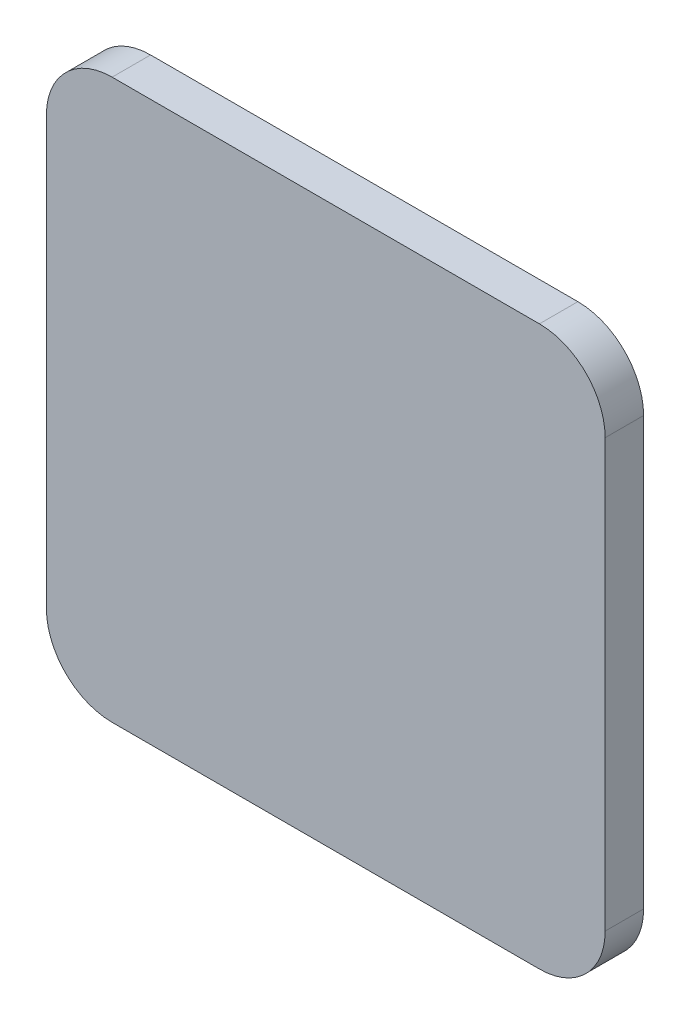
ISO-10303-21;
HEADER;
FILE_DESCRIPTION(('STEP AP214'),'2;1');
FILE_NAME('part.step','',(''),(''),'','','');
FILE_SCHEMA(('AUTOMOTIVE_DESIGN { 1 0 10303 214 1 1 1 1 }'));
ENDSEC;
DATA;
#1=APPLICATION_CONTEXT('core data for automotive mechanical design processes');
#2=APPLICATION_PROTOCOL_DEFINITION('international standard','automotive_design',2000,#1);
#3=PRODUCT_CONTEXT('',#1,'mechanical');
#4=PRODUCT('Part','Part','',(#3));
#5=PRODUCT_RELATED_PRODUCT_CATEGORY('part','',(#4));
#6=PRODUCT_DEFINITION_FORMATION('','',#4);
#7=PRODUCT_DEFINITION_CONTEXT('part definition',#1,'design');
#8=PRODUCT_DEFINITION('design','',#6,#7);
#9=PRODUCT_DEFINITION_SHAPE('','',#8);
#10=(LENGTH_UNIT() NAMED_UNIT(*) SI_UNIT(.MILLI.,.METRE.));
#11=(NAMED_UNIT(*) PLANE_ANGLE_UNIT() SI_UNIT($,.RADIAN.));
#12=(NAMED_UNIT(*) SI_UNIT($,.STERADIAN.) SOLID_ANGLE_UNIT());
#13=UNCERTAINTY_MEASURE_WITH_UNIT(LENGTH_MEASURE(1.E-05),#10,'distance_accuracy_value','');
#14=(GEOMETRIC_REPRESENTATION_CONTEXT(3) GLOBAL_UNCERTAINTY_ASSIGNED_CONTEXT((#13)) GLOBAL_UNIT_ASSIGNED_CONTEXT((#10,
#11,#12)) REPRESENTATION_CONTEXT('',''));
#15=CARTESIAN_POINT('',(0.,0.,0.));
#16=DIRECTION('',(0.,0.,1.));
#17=DIRECTION('',(1.,0.,0.));
#18=AXIS2_PLACEMENT_3D('',#15,#16,#17);
#19=CARTESIAN_POINT('',(14.781678488008,-85.1961296196214,126.358152801713));
#20=DIRECTION('',(0.,0.,-1.));
#21=DIRECTION('',(-1.,0.,0.));
#22=AXIS2_PLACEMENT_3D('',#19,#20,#21);
#23=CYLINDRICAL_SURFACE('',#22,10.);
#24=CARTESIAN_POINT('',(14.781678488008,-85.1961296196214,5.85000000000004));
#25=DIRECTION('',(0.,0.,1.));
#26=DIRECTION('',(0.,-1.,0.));
#27=AXIS2_PLACEMENT_3D('',#24,#25,#26);
#28=CIRCLE('',#27,10.);
#29=CARTESIAN_POINT('',(14.7816784880079,-95.1961296196214,5.85000000000003));
#30=VERTEX_POINT('',#29);
#31=CARTESIAN_POINT('',(24.781678488008,-85.1961296196213,5.85000000000004));
#32=VERTEX_POINT('',#31);
#33=EDGE_CURVE('E43',#30,#32,#28,.T.);
#34=ORIENTED_EDGE('',*,*,#33,.F.);
#35=DIRECTION('',(0.,0.,-1.));
#36=VECTOR('',#35,1.);
#37=CARTESIAN_POINT('',(14.7816784880079,-95.1961296196214,126.358152801713));
#38=LINE('',#37,#36);
#39=CARTESIAN_POINT('',(14.7816784880079,-95.1961296196214,0.));
#40=VERTEX_POINT('',#39);
#41=EDGE_CURVE('E38',#30,#40,#38,.T.);
#42=ORIENTED_EDGE('',*,*,#41,.T.);
#43=CARTESIAN_POINT('',(14.781678488008,-85.1961296196214,0.));
#44=DIRECTION('',(0.,0.,1.));
#45=DIRECTION('',(1.,0.,0.));
#46=AXIS2_PLACEMENT_3D('',#43,#44,#45);
#47=CIRCLE('',#46,10.);
#48=CARTESIAN_POINT('',(24.781678488008,-85.1961296196213,0.));
#49=VERTEX_POINT('',#48);
#50=EDGE_CURVE('E128',#40,#49,#47,.T.);
#51=ORIENTED_EDGE('',*,*,#50,.T.);
#52=DIRECTION('',(0.,0.,-1.));
#53=VECTOR('',#52,1.);
#54=CARTESIAN_POINT('',(24.781678488008,-85.1961296196213,126.358152801713));
#55=LINE('',#54,#53);
#56=EDGE_CURVE('E88',#32,#49,#55,.T.);
#57=ORIENTED_EDGE('',*,*,#56,.F.);
#58=EDGE_LOOP('',(#34,#42,#51,#57));
#59=FACE_BOUND('',#58,.T.);
#60=ADVANCED_FACE('F34',(#59),#23,.T.);
#61=CARTESIAN_POINT('',(24.781678488008,-85.1961296196213,126.358152801713));
#62=DIRECTION('',(-1.,0.,0.));
#63=DIRECTION('',(0.,0.,1.));
#64=AXIS2_PLACEMENT_3D('',#61,#62,#63);
#65=PLANE('',#64);
#66=DIRECTION('',(0.,1.,0.));
#67=VECTOR('',#66,1.);
#68=CARTESIAN_POINT('',(24.781678488008,-85.1961296196213,5.85000000000004));
#69=LINE('',#68,#67);
#70=CARTESIAN_POINT('',(24.781678488008,-20.1961296196215,5.85000000000004));
#71=VERTEX_POINT('',#70);
#72=EDGE_CURVE('E12',#32,#71,#69,.T.);
#73=ORIENTED_EDGE('',*,*,#72,.F.);
#74=ORIENTED_EDGE('',*,*,#56,.T.);
#75=DIRECTION('',(0.,1.,0.));
#76=VECTOR('',#75,1.);
#77=CARTESIAN_POINT('',(24.781678488008,-85.1961296196213,0.));
#78=LINE('',#77,#76);
#79=CARTESIAN_POINT('',(24.781678488008,-20.1961296196215,0.));
#80=VERTEX_POINT('',#79);
#81=EDGE_CURVE('E139',#49,#80,#78,.T.);
#82=ORIENTED_EDGE('',*,*,#81,.T.);
#83=DIRECTION('',(0.,0.,-1.));
#84=VECTOR('',#83,1.);
#85=CARTESIAN_POINT('',(24.781678488008,-20.1961296196215,126.358152801713));
#86=LINE('',#85,#84);
#87=EDGE_CURVE('E137',#71,#80,#86,.T.);
#88=ORIENTED_EDGE('',*,*,#87,.F.);
#89=EDGE_LOOP('',(#73,#74,#82,#88));
#90=FACE_BOUND('',#89,.T.);
#91=ADVANCED_FACE('F172',(#90),#65,.F.);
#92=CARTESIAN_POINT('',(14.781678488008,-20.1961296196214,126.358152801713));
#93=DIRECTION('',(0.,0.,-1.));
#94=DIRECTION('',(-1.,0.,0.));
#95=AXIS2_PLACEMENT_3D('',#92,#93,#94);
#96=CYLINDRICAL_SURFACE('',#95,10.);
#97=DIRECTION('',(0.,0.,-1.));
#98=VECTOR('',#97,1.);
#99=CARTESIAN_POINT('',(14.7816784880079,-10.1961296196214,126.358152801713));
#100=LINE('',#99,#98);
#101=CARTESIAN_POINT('',(14.7816784880079,-10.1961296196214,5.85000000000005));
#102=VERTEX_POINT('',#101);
#103=CARTESIAN_POINT('',(14.7816784880079,-10.1961296196214,0.));
#104=VERTEX_POINT('',#103);
#105=EDGE_CURVE('E134',#102,#104,#100,.T.);
#106=ORIENTED_EDGE('',*,*,#105,.F.);
#107=CARTESIAN_POINT('',(14.781678488008,-20.1961296196214,5.85000000000004));
#108=DIRECTION('',(0.,0.,1.));
#109=DIRECTION('',(0.,-1.,0.));
#110=AXIS2_PLACEMENT_3D('',#107,#108,#109);
#111=CIRCLE('',#110,10.);
#112=EDGE_CURVE('E138',#102,#71,#111,.F.);
#113=ORIENTED_EDGE('',*,*,#112,.T.);
#114=ORIENTED_EDGE('',*,*,#87,.T.);
#115=CARTESIAN_POINT('',(14.781678488008,-20.1961296196214,0.));
#116=DIRECTION('',(0.,0.,-1.));
#117=DIRECTION('',(-1.,0.,0.));
#118=AXIS2_PLACEMENT_3D('',#115,#116,#117);
#119=CIRCLE('',#118,10.);
#120=EDGE_CURVE('E117',#104,#80,#119,.T.);
#121=ORIENTED_EDGE('',*,*,#120,.F.);
#122=EDGE_LOOP('',(#106,#113,#114,#121));
#123=FACE_BOUND('',#122,.T.);
#124=ADVANCED_FACE('F175',(#123),#96,.T.);
#125=CARTESIAN_POINT('',(-50.2183215119919,-10.1961296196214,126.358152801713));
#126=DIRECTION('',(0.,1.,0.));
#127=DIRECTION('',(0.,0.,1.));
#128=AXIS2_PLACEMENT_3D('',#125,#126,#127);
#129=PLANE('',#128);
#130=DIRECTION('',(0.,0.,-1.));
#131=VECTOR('',#130,1.);
#132=CARTESIAN_POINT('',(-50.2183215119919,-10.1961296196214,126.358152801713));
#133=LINE('',#132,#131);
#134=CARTESIAN_POINT('',(-50.2183215119919,-10.1961296196214,5.85000000000004));
#135=VERTEX_POINT('',#134);
#136=CARTESIAN_POINT('',(-50.2183215119919,-10.1961296196214,0.));
#137=VERTEX_POINT('',#136);
#138=EDGE_CURVE('E131',#135,#137,#133,.T.);
#139=ORIENTED_EDGE('',*,*,#138,.F.);
#140=DIRECTION('',(1.,0.,0.));
#141=VECTOR('',#140,1.);
#142=CARTESIAN_POINT('',(-50.2183215119919,-10.1961296196214,5.85000000000005));
#143=LINE('',#142,#141);
#144=EDGE_CURVE('E135',#135,#102,#143,.T.);
#145=ORIENTED_EDGE('',*,*,#144,.T.);
#146=ORIENTED_EDGE('',*,*,#105,.T.);
#147=DIRECTION('',(1.,0.,0.));
#148=VECTOR('',#147,1.);
#149=CARTESIAN_POINT('',(-50.2183215119919,-10.1961296196214,0.));
#150=LINE('',#149,#148);
#151=EDGE_CURVE('E157',#137,#104,#150,.T.);
#152=ORIENTED_EDGE('',*,*,#151,.F.);
#153=EDGE_LOOP('',(#139,#145,#146,#152));
#154=FACE_BOUND('',#153,.T.);
#155=ADVANCED_FACE('F158',(#154),#129,.T.);
#156=CARTESIAN_POINT('',(-50.218321511992,-20.1961296196214,126.358152801713));
#157=DIRECTION('',(0.,0.,-1.));
#158=DIRECTION('',(-1.,0.,0.));
#159=AXIS2_PLACEMENT_3D('',#156,#157,#158);
#160=CYLINDRICAL_SURFACE('',#159,10.);
#161=DIRECTION('',(0.,0.,-1.));
#162=VECTOR('',#161,1.);
#163=CARTESIAN_POINT('',(-60.218321511992,-20.1961296196215,126.358152801713));
#164=LINE('',#163,#162);
#165=CARTESIAN_POINT('',(-60.218321511992,-20.1961296196215,5.85000000000004));
#166=VERTEX_POINT('',#165);
#167=CARTESIAN_POINT('',(-60.218321511992,-20.1961296196215,0.));
#168=VERTEX_POINT('',#167);
#169=EDGE_CURVE('E122',#166,#168,#164,.T.);
#170=ORIENTED_EDGE('',*,*,#169,.F.);
#171=CARTESIAN_POINT('',(-50.218321511992,-20.1961296196214,5.85000000000004));
#172=DIRECTION('',(0.,0.,1.));
#173=DIRECTION('',(0.,-1.,0.));
#174=AXIS2_PLACEMENT_3D('',#171,#172,#173);
#175=CIRCLE('',#174,10.);
#176=EDGE_CURVE('E132',#166,#135,#175,.F.);
#177=ORIENTED_EDGE('',*,*,#176,.T.);
#178=ORIENTED_EDGE('',*,*,#138,.T.);
#179=CARTESIAN_POINT('',(-50.218321511992,-20.1961296196214,0.));
#180=DIRECTION('',(0.,0.,-1.));
#181=DIRECTION('',(-1.,0.,0.));
#182=AXIS2_PLACEMENT_3D('',#179,#180,#181);
#183=CIRCLE('',#182,10.);
#184=EDGE_CURVE('E152',#168,#137,#183,.T.);
#185=ORIENTED_EDGE('',*,*,#184,.F.);
#186=EDGE_LOOP('',(#170,#177,#178,#185));
#187=FACE_BOUND('',#186,.T.);
#188=ADVANCED_FACE('F150',(#187),#160,.T.);
#189=CARTESIAN_POINT('',(-60.218321511992,-85.1961296196213,126.358152801713));
#190=DIRECTION('',(-1.,0.,0.));
#191=DIRECTION('',(0.,0.,1.));
#192=AXIS2_PLACEMENT_3D('',#189,#190,#191);
#193=PLANE('',#192);
#194=DIRECTION('',(0.,0.,-1.));
#195=VECTOR('',#194,1.);
#196=CARTESIAN_POINT('',(-60.218321511992,-85.1961296196213,126.358152801713));
#197=LINE('',#196,#195);
#198=CARTESIAN_POINT('',(-60.218321511992,-85.1961296196213,5.85000000000004));
#199=VERTEX_POINT('',#198);
#200=CARTESIAN_POINT('',(-60.218321511992,-85.1961296196213,0.));
#201=VERTEX_POINT('',#200);
#202=EDGE_CURVE('E111',#199,#201,#197,.T.);
#203=ORIENTED_EDGE('',*,*,#202,.F.);
#204=DIRECTION('',(0.,1.,0.));
#205=VECTOR('',#204,1.);
#206=CARTESIAN_POINT('',(-60.218321511992,-85.1961296196213,5.85000000000004));
#207=LINE('',#206,#205);
#208=EDGE_CURVE('E121',#199,#166,#207,.T.);
#209=ORIENTED_EDGE('',*,*,#208,.T.);
#210=ORIENTED_EDGE('',*,*,#169,.T.);
#211=DIRECTION('',(0.,1.,0.));
#212=VECTOR('',#211,1.);
#213=CARTESIAN_POINT('',(-60.218321511992,-85.1961296196213,0.));
#214=LINE('',#213,#212);
#215=EDGE_CURVE('E167',#201,#168,#214,.T.);
#216=ORIENTED_EDGE('',*,*,#215,.F.);
#217=EDGE_LOOP('',(#203,#209,#210,#216));
#218=FACE_BOUND('',#217,.T.);
#219=ADVANCED_FACE('F191',(#218),#193,.T.);
#220=CARTESIAN_POINT('',(-50.218321511992,-85.1961296196214,126.358152801713));
#221=DIRECTION('',(0.,0.,-1.));
#222=DIRECTION('',(-1.,0.,0.));
#223=AXIS2_PLACEMENT_3D('',#220,#221,#222);
#224=CYLINDRICAL_SURFACE('',#223,10.);
#225=DIRECTION('',(0.,0.,-1.));
#226=VECTOR('',#225,1.);
#227=CARTESIAN_POINT('',(-50.2183215119919,-95.1961296196214,126.358152801713));
#228=LINE('',#227,#226);
#229=CARTESIAN_POINT('',(-50.2183215119919,-95.1961296196214,5.85000000000004));
#230=VERTEX_POINT('',#229);
#231=CARTESIAN_POINT('',(-50.2183215119919,-95.1961296196214,0.));
#232=VERTEX_POINT('',#231);
#233=EDGE_CURVE('E56',#230,#232,#228,.T.);
#234=ORIENTED_EDGE('',*,*,#233,.F.);
#235=CARTESIAN_POINT('',(-50.218321511992,-85.1961296196214,5.85000000000004));
#236=DIRECTION('',(0.,0.,1.));
#237=DIRECTION('',(0.,-1.,0.));
#238=AXIS2_PLACEMENT_3D('',#235,#236,#237);
#239=CIRCLE('',#238,10.);
#240=EDGE_CURVE('E104',#230,#199,#239,.F.);
#241=ORIENTED_EDGE('',*,*,#240,.T.);
#242=ORIENTED_EDGE('',*,*,#202,.T.);
#243=CARTESIAN_POINT('',(-50.218321511992,-85.1961296196214,0.));
#244=DIRECTION('',(0.,0.,-1.));
#245=DIRECTION('',(-1.,0.,0.));
#246=AXIS2_PLACEMENT_3D('',#243,#244,#245);
#247=CIRCLE('',#246,10.);
#248=EDGE_CURVE('E109',#232,#201,#247,.T.);
#249=ORIENTED_EDGE('',*,*,#248,.F.);
#250=EDGE_LOOP('',(#234,#241,#242,#249));
#251=FACE_BOUND('',#250,.T.);
#252=ADVANCED_FACE('F107',(#251),#224,.T.);
#253=CARTESIAN_POINT('',(-50.2183215119919,-95.1961296196214,126.358152801713));
#254=DIRECTION('',(0.,1.,0.));
#255=DIRECTION('',(0.,0.,1.));
#256=AXIS2_PLACEMENT_3D('',#253,#254,#255);
#257=PLANE('',#256);
#258=DIRECTION('',(1.,0.,0.));
#259=VECTOR('',#258,1.);
#260=CARTESIAN_POINT('',(-50.2183215119919,-95.1961296196214,5.85000000000004));
#261=LINE('',#260,#259);
#262=EDGE_CURVE('E113',#230,#30,#261,.T.);
#263=ORIENTED_EDGE('',*,*,#262,.F.);
#264=ORIENTED_EDGE('',*,*,#233,.T.);
#265=DIRECTION('',(1.,0.,0.));
#266=VECTOR('',#265,1.);
#267=CARTESIAN_POINT('',(-50.2183215119919,-95.1961296196214,0.));
#268=LINE('',#267,#266);
#269=EDGE_CURVE('E110',#232,#40,#268,.T.);
#270=ORIENTED_EDGE('',*,*,#269,.T.);
#271=ORIENTED_EDGE('',*,*,#41,.F.);
#272=EDGE_LOOP('',(#263,#264,#270,#271));
#273=FACE_BOUND('',#272,.T.);
#274=ADVANCED_FACE('F114',(#273),#257,.F.);
#275=CARTESIAN_POINT('',(14.781678488008,-85.1961296196214,0.));
#276=DIRECTION('',(0.,0.,1.));
#277=DIRECTION('',(1.,0.,0.));
#278=AXIS2_PLACEMENT_3D('',#275,#276,#277);
#279=PLANE('',#278);
#280=ORIENTED_EDGE('',*,*,#50,.F.);
#281=ORIENTED_EDGE('',*,*,#269,.F.);
#282=ORIENTED_EDGE('',*,*,#248,.T.);
#283=ORIENTED_EDGE('',*,*,#215,.T.);
#284=ORIENTED_EDGE('',*,*,#184,.T.);
#285=ORIENTED_EDGE('',*,*,#151,.T.);
#286=ORIENTED_EDGE('',*,*,#120,.T.);
#287=ORIENTED_EDGE('',*,*,#81,.F.);
#288=EDGE_LOOP('',(#280,#281,#282,#283,#284,#285,#286,#287));
#289=FACE_BOUND('',#288,.T.);
#290=ADVANCED_FACE('F165',(#289),#279,.F.);
#291=CARTESIAN_POINT('',(-27.718321511992,-63.0761296196213,5.85000000000004));
#292=DIRECTION('',(0.,0.,1.));
#293=DIRECTION('',(0.,1.,0.));
#294=AXIS2_PLACEMENT_3D('',#291,#292,#293);
#295=PLANE('',#294);
#296=ORIENTED_EDGE('',*,*,#262,.T.);
#297=ORIENTED_EDGE('',*,*,#33,.T.);
#298=ORIENTED_EDGE('',*,*,#72,.T.);
#299=ORIENTED_EDGE('',*,*,#112,.F.);
#300=ORIENTED_EDGE('',*,*,#144,.F.);
#301=ORIENTED_EDGE('',*,*,#176,.F.);
#302=ORIENTED_EDGE('',*,*,#208,.F.);
#303=ORIENTED_EDGE('',*,*,#240,.F.);
#304=EDGE_LOOP('',(#296,#297,#298,#299,#300,#301,#302,#303));
#305=FACE_BOUND('',#304,.T.);
#306=ADVANCED_FACE('F36',(#305),#295,.T.);
#307=CLOSED_SHELL('',(#60,#91,#124,#155,#188,#219,#252,#274,#290,#306));
#308=MANIFOLD_SOLID_BREP('B2',#307);
#309=ADVANCED_BREP_SHAPE_REPRESENTATION('',(#18,#308),#14);
#310=SHAPE_DEFINITION_REPRESENTATION(#9,#309);
ENDSEC;
END-ISO-10303-21;
